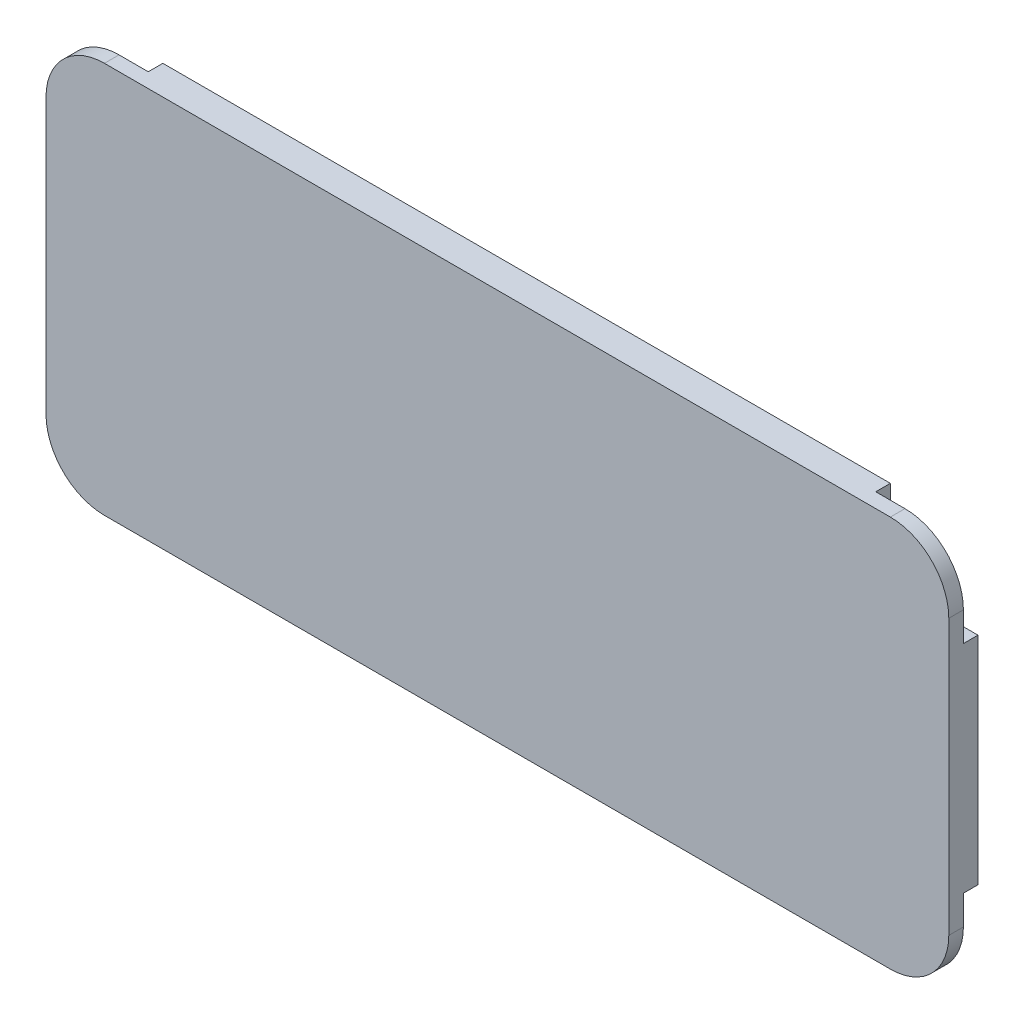
ISO-10303-21;
HEADER;
FILE_DESCRIPTION(('STEP AP214'),'2;1');
FILE_NAME('part.step','',(''),(''),'','','');
FILE_SCHEMA(('AUTOMOTIVE_DESIGN { 1 0 10303 214 1 1 1 1 }'));
ENDSEC;
DATA;
#1=APPLICATION_CONTEXT('core data for automotive mechanical design processes');
#2=APPLICATION_PROTOCOL_DEFINITION('international standard','automotive_design',2000,#1);
#3=PRODUCT_CONTEXT('',#1,'mechanical');
#4=PRODUCT('Part','Part','',(#3));
#5=PRODUCT_RELATED_PRODUCT_CATEGORY('part','',(#4));
#6=PRODUCT_DEFINITION_FORMATION('','',#4);
#7=PRODUCT_DEFINITION_CONTEXT('part definition',#1,'design');
#8=PRODUCT_DEFINITION('design','',#6,#7);
#9=PRODUCT_DEFINITION_SHAPE('','',#8);
#10=(LENGTH_UNIT() NAMED_UNIT(*) SI_UNIT(.MILLI.,.METRE.));
#11=(NAMED_UNIT(*) PLANE_ANGLE_UNIT() SI_UNIT($,.RADIAN.));
#12=(NAMED_UNIT(*) SI_UNIT($,.STERADIAN.) SOLID_ANGLE_UNIT());
#13=UNCERTAINTY_MEASURE_WITH_UNIT(LENGTH_MEASURE(1.E-05),#10,'distance_accuracy_value','');
#14=(GEOMETRIC_REPRESENTATION_CONTEXT(3) GLOBAL_UNCERTAINTY_ASSIGNED_CONTEXT((#13)) GLOBAL_UNIT_ASSIGNED_CONTEXT((#10,
#11,#12)) REPRESENTATION_CONTEXT('',''));
#15=CARTESIAN_POINT('',(0.,0.,0.));
#16=DIRECTION('',(0.,0.,1.));
#17=DIRECTION('',(1.,0.,0.));
#18=AXIS2_PLACEMENT_3D('',#15,#16,#17);
#19=CARTESIAN_POINT('',(2.,2.,1.));
#20=DIRECTION('',(0.,0.,-1.));
#21=DIRECTION('',(-1.,0.,0.));
#22=AXIS2_PLACEMENT_3D('',#19,#20,#21);
#23=CYLINDRICAL_SURFACE('',#22,2.);
#24=CARTESIAN_POINT('',(2.,2.,0.5));
#25=DIRECTION('',(0.,0.,-1.));
#26=DIRECTION('',(-1.,0.,0.));
#27=AXIS2_PLACEMENT_3D('',#24,#25,#26);
#28=CIRCLE('',#27,2.);
#29=CARTESIAN_POINT('',(2.00000000000001,0.,0.5));
#30=VERTEX_POINT('',#29);
#31=CARTESIAN_POINT('',(0.,1.99999999999998,0.5));
#32=VERTEX_POINT('',#31);
#33=EDGE_CURVE('E294',#30,#32,#28,.T.);
#34=ORIENTED_EDGE('',*,*,#33,.F.);
#35=DIRECTION('',(0.,0.,-1.));
#36=VECTOR('',#35,1.);
#37=CARTESIAN_POINT('',(2.00000000000001,0.,1.));
#38=LINE('',#37,#36);
#39=CARTESIAN_POINT('',(2.00000000000001,0.,1.));
#40=VERTEX_POINT('',#39);
#41=EDGE_CURVE('E372',#40,#30,#38,.T.);
#42=ORIENTED_EDGE('',*,*,#41,.F.);
#43=CARTESIAN_POINT('',(2.,2.,1.));
#44=DIRECTION('',(0.,0.,1.));
#45=DIRECTION('',(-1.,0.,0.));
#46=AXIS2_PLACEMENT_3D('',#43,#44,#45);
#47=CIRCLE('',#46,2.);
#48=CARTESIAN_POINT('',(0.,2.00000000000001,1.));
#49=VERTEX_POINT('',#48);
#50=EDGE_CURVE('E336',#49,#40,#47,.T.);
#51=ORIENTED_EDGE('',*,*,#50,.F.);
#52=DIRECTION('',(0.,0.,-1.));
#53=VECTOR('',#52,1.);
#54=CARTESIAN_POINT('',(0.,2.00000000000001,1.));
#55=LINE('',#54,#53);
#56=EDGE_CURVE('E41',#49,#32,#55,.T.);
#57=ORIENTED_EDGE('',*,*,#56,.T.);
#58=EDGE_LOOP('',(#34,#42,#51,#57));
#59=FACE_BOUND('',#58,.T.);
#60=ADVANCED_FACE('F33',(#59),#23,.T.);
#61=CARTESIAN_POINT('',(28.9,11.4,1.));
#62=DIRECTION('',(0.,0.,-1.));
#63=DIRECTION('',(-1.,0.,0.));
#64=AXIS2_PLACEMENT_3D('',#61,#62,#63);
#65=CYLINDRICAL_SURFACE('',#64,2.);
#66=CARTESIAN_POINT('',(28.9,11.4,0.5));
#67=DIRECTION('',(0.,0.,-1.));
#68=DIRECTION('',(-1.,0.,0.));
#69=AXIS2_PLACEMENT_3D('',#66,#67,#68);
#70=CIRCLE('',#69,2.);
#71=CARTESIAN_POINT('',(28.9,13.4,0.5));
#72=VERTEX_POINT('',#71);
#73=CARTESIAN_POINT('',(30.9,11.4,0.5));
#74=VERTEX_POINT('',#73);
#75=EDGE_CURVE('E321',#72,#74,#70,.T.);
#76=ORIENTED_EDGE('',*,*,#75,.F.);
#77=DIRECTION('',(0.,0.,-1.));
#78=VECTOR('',#77,1.);
#79=CARTESIAN_POINT('',(28.9,13.4,1.));
#80=LINE('',#79,#78);
#81=CARTESIAN_POINT('',(28.9,13.4,1.));
#82=VERTEX_POINT('',#81);
#83=EDGE_CURVE('E360',#82,#72,#80,.T.);
#84=ORIENTED_EDGE('',*,*,#83,.F.);
#85=CARTESIAN_POINT('',(28.9,11.4,1.));
#86=DIRECTION('',(0.,0.,1.));
#87=DIRECTION('',(-1.,0.,0.));
#88=AXIS2_PLACEMENT_3D('',#85,#86,#87);
#89=CIRCLE('',#88,2.);
#90=CARTESIAN_POINT('',(30.9,11.4,1.));
#91=VERTEX_POINT('',#90);
#92=EDGE_CURVE('E344',#91,#82,#89,.T.);
#93=ORIENTED_EDGE('',*,*,#92,.F.);
#94=DIRECTION('',(0.,0.,-1.));
#95=VECTOR('',#94,1.);
#96=CARTESIAN_POINT('',(30.9,11.4,1.));
#97=LINE('',#96,#95);
#98=EDGE_CURVE('E363',#91,#74,#97,.T.);
#99=ORIENTED_EDGE('',*,*,#98,.T.);
#100=EDGE_LOOP('',(#76,#84,#93,#99));
#101=FACE_BOUND('',#100,.T.);
#102=ADVANCED_FACE('F435',(#101),#65,.T.);
#103=CARTESIAN_POINT('',(2.,11.4,1.));
#104=DIRECTION('',(0.,0.,-1.));
#105=DIRECTION('',(-1.,0.,0.));
#106=AXIS2_PLACEMENT_3D('',#103,#104,#105);
#107=CYLINDRICAL_SURFACE('',#106,2.);
#108=DIRECTION('',(0.,0.,-1.));
#109=VECTOR('',#108,1.);
#110=CARTESIAN_POINT('',(2.,13.4,1.));
#111=LINE('',#110,#109);
#112=CARTESIAN_POINT('',(2.,13.4,1.));
#113=VERTEX_POINT('',#112);
#114=CARTESIAN_POINT('',(2.,13.4,0.5));
#115=VERTEX_POINT('',#114);
#116=EDGE_CURVE('E348',#113,#115,#111,.T.);
#117=ORIENTED_EDGE('',*,*,#116,.T.);
#118=CARTESIAN_POINT('',(2.,11.4,0.5));
#119=DIRECTION('',(0.,0.,1.));
#120=DIRECTION('',(1.,0.,0.));
#121=AXIS2_PLACEMENT_3D('',#118,#119,#120);
#122=CIRCLE('',#121,2.);
#123=CARTESIAN_POINT('',(0.,11.4,0.5));
#124=VERTEX_POINT('',#123);
#125=EDGE_CURVE('E228',#115,#124,#122,.T.);
#126=ORIENTED_EDGE('',*,*,#125,.T.);
#127=DIRECTION('',(0.,0.,-1.));
#128=VECTOR('',#127,1.);
#129=CARTESIAN_POINT('',(0.,11.4,1.));
#130=LINE('',#129,#128);
#131=CARTESIAN_POINT('',(0.,11.4,1.));
#132=VERTEX_POINT('',#131);
#133=EDGE_CURVE('E11',#132,#124,#130,.T.);
#134=ORIENTED_EDGE('',*,*,#133,.F.);
#135=CARTESIAN_POINT('',(2.,11.4,1.));
#136=DIRECTION('',(0.,0.,1.));
#137=DIRECTION('',(-1.,0.,0.));
#138=AXIS2_PLACEMENT_3D('',#135,#136,#137);
#139=CIRCLE('',#138,2.);
#140=EDGE_CURVE('E330',#113,#132,#139,.T.);
#141=ORIENTED_EDGE('',*,*,#140,.F.);
#142=EDGE_LOOP('',(#117,#126,#134,#141));
#143=FACE_BOUND('',#142,.T.);
#144=ADVANCED_FACE('F35',(#143),#107,.T.);
#145=CARTESIAN_POINT('',(0.,2.00000000000001,1.));
#146=DIRECTION('',(1.,0.,0.));
#147=DIRECTION('',(0.,0.,-1.));
#148=AXIS2_PLACEMENT_3D('',#145,#146,#147);
#149=PLANE('',#148);
#150=DIRECTION('',(0.,1.,0.));
#151=VECTOR('',#150,1.);
#152=CARTESIAN_POINT('',(0.,13.4,0.5));
#153=LINE('',#152,#151);
#154=CARTESIAN_POINT('',(0.,10.4,0.5));
#155=VERTEX_POINT('',#154);
#156=EDGE_CURVE('E209',#155,#124,#153,.T.);
#157=ORIENTED_EDGE('',*,*,#156,.F.);
#158=DIRECTION('',(0.,0.,-1.));
#159=VECTOR('',#158,1.);
#160=CARTESIAN_POINT('',(0.,10.4,0.5));
#161=LINE('',#160,#159);
#162=CARTESIAN_POINT('',(0.,10.4,0.));
#163=VERTEX_POINT('',#162);
#164=EDGE_CURVE('E200',#155,#163,#161,.T.);
#165=ORIENTED_EDGE('',*,*,#164,.T.);
#166=DIRECTION('',(0.,-1.,0.));
#167=VECTOR('',#166,1.);
#168=CARTESIAN_POINT('',(0.,2.00000000000001,0.));
#169=LINE('',#168,#167);
#170=CARTESIAN_POINT('',(0.,3.,0.));
#171=VERTEX_POINT('',#170);
#172=EDGE_CURVE('E329',#163,#171,#169,.T.);
#173=ORIENTED_EDGE('',*,*,#172,.T.);
#174=DIRECTION('',(0.,0.,-1.));
#175=VECTOR('',#174,1.);
#176=CARTESIAN_POINT('',(0.,3.,0.5));
#177=LINE('',#176,#175);
#178=CARTESIAN_POINT('',(0.,3.,0.5));
#179=VERTEX_POINT('',#178);
#180=EDGE_CURVE('E254',#179,#171,#177,.T.);
#181=ORIENTED_EDGE('',*,*,#180,.F.);
#182=DIRECTION('',(0.,1.,0.));
#183=VECTOR('',#182,1.);
#184=CARTESIAN_POINT('',(0.,0.,0.5));
#185=LINE('',#184,#183);
#186=EDGE_CURVE('E241',#32,#179,#185,.T.);
#187=ORIENTED_EDGE('',*,*,#186,.F.);
#188=ORIENTED_EDGE('',*,*,#56,.F.);
#189=DIRECTION('',(0.,-1.,0.));
#190=VECTOR('',#189,1.);
#191=CARTESIAN_POINT('',(0.,2.00000000000001,1.));
#192=LINE('',#191,#190);
#193=EDGE_CURVE('E333',#132,#49,#192,.T.);
#194=ORIENTED_EDGE('',*,*,#193,.F.);
#195=ORIENTED_EDGE('',*,*,#133,.T.);
#196=EDGE_LOOP('',(#157,#165,#173,#181,#187,#188,#194,#195));
#197=FACE_BOUND('',#196,.T.);
#198=ADVANCED_FACE('F382',(#197),#149,.F.);
#199=CARTESIAN_POINT('',(2.00000000000001,0.,1.));
#200=DIRECTION('',(0.,1.,0.));
#201=DIRECTION('',(0.,0.,1.));
#202=AXIS2_PLACEMENT_3D('',#199,#200,#201);
#203=PLANE('',#202);
#204=DIRECTION('',(-1.,0.,0.));
#205=VECTOR('',#204,1.);
#206=CARTESIAN_POINT('',(0.,0.,0.5));
#207=LINE('',#206,#205);
#208=CARTESIAN_POINT('',(3.,0.,0.5));
#209=VERTEX_POINT('',#208);
#210=EDGE_CURVE('E239',#209,#30,#207,.T.);
#211=ORIENTED_EDGE('',*,*,#210,.F.);
#212=DIRECTION('',(0.,0.,-1.));
#213=VECTOR('',#212,1.);
#214=CARTESIAN_POINT('',(3.,0.,0.5));
#215=LINE('',#214,#213);
#216=CARTESIAN_POINT('',(3.,0.,0.));
#217=VERTEX_POINT('',#216);
#218=EDGE_CURVE('E256',#209,#217,#215,.T.);
#219=ORIENTED_EDGE('',*,*,#218,.T.);
#220=DIRECTION('',(1.,0.,0.));
#221=VECTOR('',#220,1.);
#222=CARTESIAN_POINT('',(2.00000000000001,0.,0.));
#223=LINE('',#222,#221);
#224=CARTESIAN_POINT('',(27.9,0.,0.));
#225=VERTEX_POINT('',#224);
#226=EDGE_CURVE('E351',#217,#225,#223,.T.);
#227=ORIENTED_EDGE('',*,*,#226,.T.);
#228=DIRECTION('',(0.,0.,-1.));
#229=VECTOR('',#228,1.);
#230=CARTESIAN_POINT('',(27.9,0.,0.5));
#231=LINE('',#230,#229);
#232=CARTESIAN_POINT('',(27.9,0.,0.5));
#233=VERTEX_POINT('',#232);
#234=EDGE_CURVE('E282',#233,#225,#231,.T.);
#235=ORIENTED_EDGE('',*,*,#234,.F.);
#236=DIRECTION('',(-1.,0.,0.));
#237=VECTOR('',#236,1.);
#238=CARTESIAN_POINT('',(30.9,0.,0.5));
#239=LINE('',#238,#237);
#240=CARTESIAN_POINT('',(28.9,0.,0.5));
#241=VERTEX_POINT('',#240);
#242=EDGE_CURVE('E269',#241,#233,#239,.T.);
#243=ORIENTED_EDGE('',*,*,#242,.F.);
#244=DIRECTION('',(0.,0.,-1.));
#245=VECTOR('',#244,1.);
#246=CARTESIAN_POINT('',(28.9,0.,1.));
#247=LINE('',#246,#245);
#248=CARTESIAN_POINT('',(28.9,0.,1.));
#249=VERTEX_POINT('',#248);
#250=EDGE_CURVE('E369',#249,#241,#247,.T.);
#251=ORIENTED_EDGE('',*,*,#250,.F.);
#252=DIRECTION('',(1.,0.,0.));
#253=VECTOR('',#252,1.);
#254=CARTESIAN_POINT('',(2.00000000000001,0.,1.));
#255=LINE('',#254,#253);
#256=EDGE_CURVE('E338',#40,#249,#255,.T.);
#257=ORIENTED_EDGE('',*,*,#256,.F.);
#258=ORIENTED_EDGE('',*,*,#41,.T.);
#259=EDGE_LOOP('',(#211,#219,#227,#235,#243,#251,#257,#258));
#260=FACE_BOUND('',#259,.T.);
#261=ADVANCED_FACE('F396',(#260),#203,.F.);
#262=CARTESIAN_POINT('',(28.9,2.,1.));
#263=DIRECTION('',(0.,0.,-1.));
#264=DIRECTION('',(-1.,0.,0.));
#265=AXIS2_PLACEMENT_3D('',#262,#263,#264);
#266=CYLINDRICAL_SURFACE('',#265,2.);
#267=ORIENTED_EDGE('',*,*,#250,.T.);
#268=CARTESIAN_POINT('',(28.9,2.,0.5));
#269=DIRECTION('',(0.,0.,1.));
#270=DIRECTION('',(1.,0.,0.));
#271=AXIS2_PLACEMENT_3D('',#268,#269,#270);
#272=CIRCLE('',#271,2.);
#273=CARTESIAN_POINT('',(30.9,2.,0.5));
#274=VERTEX_POINT('',#273);
#275=EDGE_CURVE('E291',#241,#274,#272,.T.);
#276=ORIENTED_EDGE('',*,*,#275,.T.);
#277=DIRECTION('',(0.,0.,-1.));
#278=VECTOR('',#277,1.);
#279=CARTESIAN_POINT('',(30.9,2.,1.));
#280=LINE('',#279,#278);
#281=CARTESIAN_POINT('',(30.9,2.,1.));
#282=VERTEX_POINT('',#281);
#283=EDGE_CURVE('E366',#282,#274,#280,.T.);
#284=ORIENTED_EDGE('',*,*,#283,.F.);
#285=CARTESIAN_POINT('',(28.9,2.,1.));
#286=DIRECTION('',(0.,0.,1.));
#287=DIRECTION('',(1.,0.,0.));
#288=AXIS2_PLACEMENT_3D('',#285,#286,#287);
#289=CIRCLE('',#288,2.);
#290=EDGE_CURVE('E340',#249,#282,#289,.T.);
#291=ORIENTED_EDGE('',*,*,#290,.F.);
#292=EDGE_LOOP('',(#267,#276,#284,#291));
#293=FACE_BOUND('',#292,.T.);
#294=ADVANCED_FACE('F449',(#293),#266,.T.);
#295=CARTESIAN_POINT('',(30.9,2.,1.));
#296=DIRECTION('',(-1.,0.,0.));
#297=DIRECTION('',(0.,0.,1.));
#298=AXIS2_PLACEMENT_3D('',#295,#296,#297);
#299=PLANE('',#298);
#300=DIRECTION('',(0.,-1.,0.));
#301=VECTOR('',#300,1.);
#302=CARTESIAN_POINT('',(30.9,0.,0.5));
#303=LINE('',#302,#301);
#304=CARTESIAN_POINT('',(30.9,3.,0.5));
#305=VERTEX_POINT('',#304);
#306=EDGE_CURVE('E267',#305,#274,#303,.T.);
#307=ORIENTED_EDGE('',*,*,#306,.F.);
#308=DIRECTION('',(0.,0.,-1.));
#309=VECTOR('',#308,1.);
#310=CARTESIAN_POINT('',(30.9,3.,0.5));
#311=LINE('',#310,#309);
#312=CARTESIAN_POINT('',(30.9,3.,0.));
#313=VERTEX_POINT('',#312);
#314=EDGE_CURVE('E284',#305,#313,#311,.T.);
#315=ORIENTED_EDGE('',*,*,#314,.T.);
#316=DIRECTION('',(0.,1.,0.));
#317=VECTOR('',#316,1.);
#318=CARTESIAN_POINT('',(30.9,2.,0.));
#319=LINE('',#318,#317);
#320=CARTESIAN_POINT('',(30.9,10.4,0.));
#321=VERTEX_POINT('',#320);
#322=EDGE_CURVE('E354',#313,#321,#319,.T.);
#323=ORIENTED_EDGE('',*,*,#322,.T.);
#324=DIRECTION('',(0.,0.,-1.));
#325=VECTOR('',#324,1.);
#326=CARTESIAN_POINT('',(30.9,10.4,0.5));
#327=LINE('',#326,#325);
#328=CARTESIAN_POINT('',(30.9,10.4,0.5));
#329=VERTEX_POINT('',#328);
#330=EDGE_CURVE('E311',#329,#321,#327,.T.);
#331=ORIENTED_EDGE('',*,*,#330,.F.);
#332=DIRECTION('',(0.,-1.,0.));
#333=VECTOR('',#332,1.);
#334=CARTESIAN_POINT('',(30.9,13.4,0.5));
#335=LINE('',#334,#333);
#336=EDGE_CURVE('E297',#74,#329,#335,.T.);
#337=ORIENTED_EDGE('',*,*,#336,.F.);
#338=ORIENTED_EDGE('',*,*,#98,.F.);
#339=DIRECTION('',(0.,1.,0.));
#340=VECTOR('',#339,1.);
#341=CARTESIAN_POINT('',(30.9,2.,1.));
#342=LINE('',#341,#340);
#343=EDGE_CURVE('E342',#282,#91,#342,.T.);
#344=ORIENTED_EDGE('',*,*,#343,.F.);
#345=ORIENTED_EDGE('',*,*,#283,.T.);
#346=EDGE_LOOP('',(#307,#315,#323,#331,#337,#338,#344,#345));
#347=FACE_BOUND('',#346,.T.);
#348=ADVANCED_FACE('F619',(#347),#299,.F.);
#349=CARTESIAN_POINT('',(2.,13.4,1.));
#350=DIRECTION('',(0.,-1.,0.));
#351=DIRECTION('',(0.,0.,-1.));
#352=AXIS2_PLACEMENT_3D('',#349,#350,#351);
#353=PLANE('',#352);
#354=DIRECTION('',(-1.,0.,0.));
#355=VECTOR('',#354,1.);
#356=CARTESIAN_POINT('',(2.,13.4,0.));
#357=LINE('',#356,#355);
#358=CARTESIAN_POINT('',(27.9,13.4,0.));
#359=VERTEX_POINT('',#358);
#360=CARTESIAN_POINT('',(3.,13.4,0.));
#361=VERTEX_POINT('',#360);
#362=EDGE_CURVE('E334',#359,#361,#357,.T.);
#363=ORIENTED_EDGE('',*,*,#362,.T.);
#364=DIRECTION('',(0.,0.,-1.));
#365=VECTOR('',#364,1.);
#366=CARTESIAN_POINT('',(3.,13.4,0.5));
#367=LINE('',#366,#365);
#368=CARTESIAN_POINT('',(3.,13.4,0.5));
#369=VERTEX_POINT('',#368);
#370=EDGE_CURVE('E229',#369,#361,#367,.T.);
#371=ORIENTED_EDGE('',*,*,#370,.F.);
#372=DIRECTION('',(1.,0.,0.));
#373=VECTOR('',#372,1.);
#374=CARTESIAN_POINT('',(0.,13.4,0.5));
#375=LINE('',#374,#373);
#376=EDGE_CURVE('E220',#115,#369,#375,.T.);
#377=ORIENTED_EDGE('',*,*,#376,.F.);
#378=ORIENTED_EDGE('',*,*,#116,.F.);
#379=DIRECTION('',(-1.,0.,0.));
#380=VECTOR('',#379,1.);
#381=CARTESIAN_POINT('',(2.,13.4,1.));
#382=LINE('',#381,#380);
#383=EDGE_CURVE('E346',#82,#113,#382,.T.);
#384=ORIENTED_EDGE('',*,*,#383,.F.);
#385=ORIENTED_EDGE('',*,*,#83,.T.);
#386=DIRECTION('',(1.,0.,0.));
#387=VECTOR('',#386,1.);
#388=CARTESIAN_POINT('',(30.9,13.4,0.5));
#389=LINE('',#388,#387);
#390=CARTESIAN_POINT('',(27.9,13.4,0.5));
#391=VERTEX_POINT('',#390);
#392=EDGE_CURVE('E309',#391,#72,#389,.T.);
#393=ORIENTED_EDGE('',*,*,#392,.F.);
#394=DIRECTION('',(0.,0.,-1.));
#395=VECTOR('',#394,1.);
#396=CARTESIAN_POINT('',(27.9,13.4,0.5));
#397=LINE('',#396,#395);
#398=EDGE_CURVE('E318',#391,#359,#397,.T.);
#399=ORIENTED_EDGE('',*,*,#398,.T.);
#400=EDGE_LOOP('',(#363,#371,#377,#378,#384,#385,#393,#399));
#401=FACE_BOUND('',#400,.T.);
#402=ADVANCED_FACE('F414',(#401),#353,.F.);
#403=CARTESIAN_POINT('',(2.,11.4,1.));
#404=DIRECTION('',(0.,0.,-1.));
#405=DIRECTION('',(-1.,0.,0.));
#406=AXIS2_PLACEMENT_3D('',#403,#404,#405);
#407=PLANE('',#406);
#408=ORIENTED_EDGE('',*,*,#140,.T.);
#409=ORIENTED_EDGE('',*,*,#193,.T.);
#410=ORIENTED_EDGE('',*,*,#50,.T.);
#411=ORIENTED_EDGE('',*,*,#256,.T.);
#412=ORIENTED_EDGE('',*,*,#290,.T.);
#413=ORIENTED_EDGE('',*,*,#343,.T.);
#414=ORIENTED_EDGE('',*,*,#92,.T.);
#415=ORIENTED_EDGE('',*,*,#383,.T.);
#416=EDGE_LOOP('',(#408,#409,#410,#411,#412,#413,#414,#415));
#417=FACE_BOUND('',#416,.T.);
#418=ADVANCED_FACE('F403',(#417),#407,.F.);
#419=CARTESIAN_POINT('',(2.,11.4,0.));
#420=DIRECTION('',(0.,0.,-1.));
#421=DIRECTION('',(-1.,0.,0.));
#422=AXIS2_PLACEMENT_3D('',#419,#420,#421);
#423=PLANE('',#422);
#424=DIRECTION('',(0.,-1.,0.));
#425=VECTOR('',#424,1.);
#426=CARTESIAN_POINT('',(3.,13.4,0.));
#427=LINE('',#426,#425);
#428=CARTESIAN_POINT('',(2.99999999999998,10.9,0.));
#429=VERTEX_POINT('',#428);
#430=EDGE_CURVE('E213',#361,#429,#427,.T.);
#431=ORIENTED_EDGE('',*,*,#430,.F.);
#432=ORIENTED_EDGE('',*,*,#362,.F.);
#433=DIRECTION('',(0.,1.,0.));
#434=VECTOR('',#433,1.);
#435=CARTESIAN_POINT('',(27.9,13.4,0.));
#436=LINE('',#435,#434);
#437=CARTESIAN_POINT('',(27.9,10.9,0.));
#438=VERTEX_POINT('',#437);
#439=EDGE_CURVE('E300',#438,#359,#436,.T.);
#440=ORIENTED_EDGE('',*,*,#439,.F.);
#441=CARTESIAN_POINT('',(28.4,10.9,0.));
#442=DIRECTION('',(0.,0.,-1.));
#443=DIRECTION('',(-1.,0.,0.));
#444=AXIS2_PLACEMENT_3D('',#441,#442,#443);
#445=CIRCLE('',#444,0.5);
#446=CARTESIAN_POINT('',(28.4,10.4,0.));
#447=VERTEX_POINT('',#446);
#448=EDGE_CURVE('E314',#447,#438,#445,.T.);
#449=ORIENTED_EDGE('',*,*,#448,.F.);
#450=DIRECTION('',(-1.,0.,0.));
#451=VECTOR('',#450,1.);
#452=CARTESIAN_POINT('',(30.9,10.4,0.));
#453=LINE('',#452,#451);
#454=EDGE_CURVE('E296',#321,#447,#453,.T.);
#455=ORIENTED_EDGE('',*,*,#454,.F.);
#456=ORIENTED_EDGE('',*,*,#322,.F.);
#457=DIRECTION('',(1.,0.,0.));
#458=VECTOR('',#457,1.);
#459=CARTESIAN_POINT('',(30.9,3.,0.));
#460=LINE('',#459,#458);
#461=CARTESIAN_POINT('',(28.4,3.,0.));
#462=VERTEX_POINT('',#461);
#463=EDGE_CURVE('E277',#462,#313,#460,.T.);
#464=ORIENTED_EDGE('',*,*,#463,.F.);
#465=CARTESIAN_POINT('',(28.4,2.5,0.));
#466=DIRECTION('',(0.,0.,-1.));
#467=DIRECTION('',(1.,0.,0.));
#468=AXIS2_PLACEMENT_3D('',#465,#466,#467);
#469=CIRCLE('',#468,0.5);
#470=CARTESIAN_POINT('',(27.9,2.49999999999999,0.));
#471=VERTEX_POINT('',#470);
#472=EDGE_CURVE('E275',#471,#462,#469,.T.);
#473=ORIENTED_EDGE('',*,*,#472,.F.);
#474=DIRECTION('',(0.,1.,0.));
#475=VECTOR('',#474,1.);
#476=CARTESIAN_POINT('',(27.9,0.,0.));
#477=LINE('',#476,#475);
#478=EDGE_CURVE('E264',#225,#471,#477,.T.);
#479=ORIENTED_EDGE('',*,*,#478,.F.);
#480=ORIENTED_EDGE('',*,*,#226,.F.);
#481=DIRECTION('',(0.,-1.,0.));
#482=VECTOR('',#481,1.);
#483=CARTESIAN_POINT('',(3.,0.,0.));
#484=LINE('',#483,#482);
#485=CARTESIAN_POINT('',(2.99999999999998,2.49999999999999,0.));
#486=VERTEX_POINT('',#485);
#487=EDGE_CURVE('E248',#486,#217,#484,.T.);
#488=ORIENTED_EDGE('',*,*,#487,.F.);
#489=CARTESIAN_POINT('',(2.49999999999998,2.5,0.));
#490=DIRECTION('',(0.,0.,-1.));
#491=DIRECTION('',(-1.,0.,0.));
#492=AXIS2_PLACEMENT_3D('',#489,#490,#491);
#493=CIRCLE('',#492,0.5);
#494=CARTESIAN_POINT('',(2.49999999999997,3.,0.));
#495=VERTEX_POINT('',#494);
#496=EDGE_CURVE('E56',#495,#486,#493,.T.);
#497=ORIENTED_EDGE('',*,*,#496,.F.);
#498=DIRECTION('',(1.,0.,0.));
#499=VECTOR('',#498,1.);
#500=CARTESIAN_POINT('',(0.,3.,0.));
#501=LINE('',#500,#499);
#502=EDGE_CURVE('E236',#171,#495,#501,.T.);
#503=ORIENTED_EDGE('',*,*,#502,.F.);
#504=ORIENTED_EDGE('',*,*,#172,.F.);
#505=DIRECTION('',(-1.,0.,0.));
#506=VECTOR('',#505,1.);
#507=CARTESIAN_POINT('',(0.,10.4,0.));
#508=LINE('',#507,#506);
#509=CARTESIAN_POINT('',(2.49999999999997,10.4,0.));
#510=VERTEX_POINT('',#509);
#511=EDGE_CURVE('E216',#510,#163,#508,.T.);
#512=ORIENTED_EDGE('',*,*,#511,.F.);
#513=CARTESIAN_POINT('',(2.49999999999998,10.9,0.));
#514=DIRECTION('',(0.,0.,-1.));
#515=DIRECTION('',(1.,0.,0.));
#516=AXIS2_PLACEMENT_3D('',#513,#514,#515);
#517=CIRCLE('',#516,0.5);
#518=EDGE_CURVE('E48',#429,#510,#517,.T.);
#519=ORIENTED_EDGE('',*,*,#518,.F.);
#520=EDGE_LOOP('',(#431,#432,#440,#449,#455,#456,#464,#473,#479,#480,#488,#497,#503,#504,#512,#519));
#521=FACE_BOUND('',#520,.T.);
#522=ADVANCED_FACE('F420',(#521),#423,.T.);
#523=CARTESIAN_POINT('',(28.4,10.9,0.5));
#524=DIRECTION('',(0.,0.,-1.));
#525=DIRECTION('',(-1.,0.,0.));
#526=AXIS2_PLACEMENT_3D('',#523,#524,#525);
#527=PLANE('',#526);
#528=ORIENTED_EDGE('',*,*,#75,.T.);
#529=ORIENTED_EDGE('',*,*,#336,.T.);
#530=DIRECTION('',(-1.,0.,0.));
#531=VECTOR('',#530,1.);
#532=CARTESIAN_POINT('',(30.9,10.4,0.5));
#533=LINE('',#532,#531);
#534=CARTESIAN_POINT('',(28.4,10.4,0.5));
#535=VERTEX_POINT('',#534);
#536=EDGE_CURVE('E299',#329,#535,#533,.T.);
#537=ORIENTED_EDGE('',*,*,#536,.T.);
#538=CARTESIAN_POINT('',(28.4,10.9,0.5));
#539=DIRECTION('',(0.,0.,-1.));
#540=DIRECTION('',(-1.,0.,0.));
#541=AXIS2_PLACEMENT_3D('',#538,#539,#540);
#542=CIRCLE('',#541,0.5);
#543=CARTESIAN_POINT('',(27.9,10.9,0.5));
#544=VERTEX_POINT('',#543);
#545=EDGE_CURVE('E303',#535,#544,#542,.T.);
#546=ORIENTED_EDGE('',*,*,#545,.T.);
#547=DIRECTION('',(0.,1.,0.));
#548=VECTOR('',#547,1.);
#549=CARTESIAN_POINT('',(27.9,13.4,0.5));
#550=LINE('',#549,#548);
#551=EDGE_CURVE('E306',#544,#391,#550,.T.);
#552=ORIENTED_EDGE('',*,*,#551,.T.);
#553=ORIENTED_EDGE('',*,*,#392,.T.);
#554=EDGE_LOOP('',(#528,#529,#537,#546,#552,#553));
#555=FACE_BOUND('',#554,.T.);
#556=ADVANCED_FACE('F483',(#555),#527,.T.);
#557=CARTESIAN_POINT('',(27.9,13.4,0.5));
#558=DIRECTION('',(-1.,0.,0.));
#559=DIRECTION('',(0.,0.,1.));
#560=AXIS2_PLACEMENT_3D('',#557,#558,#559);
#561=PLANE('',#560);
#562=ORIENTED_EDGE('',*,*,#439,.T.);
#563=ORIENTED_EDGE('',*,*,#398,.F.);
#564=ORIENTED_EDGE('',*,*,#551,.F.);
#565=DIRECTION('',(0.,0.,-1.));
#566=VECTOR('',#565,1.);
#567=CARTESIAN_POINT('',(27.9,10.9,0.5));
#568=LINE('',#567,#566);
#569=EDGE_CURVE('E322',#544,#438,#568,.T.);
#570=ORIENTED_EDGE('',*,*,#569,.T.);
#571=EDGE_LOOP('',(#562,#563,#564,#570));
#572=FACE_BOUND('',#571,.T.);
#573=ADVANCED_FACE('F489',(#572),#561,.F.);
#574=CARTESIAN_POINT('',(28.4,10.9,0.5));
#575=DIRECTION('',(0.,0.,-1.));
#576=DIRECTION('',(-1.,0.,0.));
#577=AXIS2_PLACEMENT_3D('',#574,#575,#576);
#578=CYLINDRICAL_SURFACE('',#577,0.5);
#579=ORIENTED_EDGE('',*,*,#448,.T.);
#580=ORIENTED_EDGE('',*,*,#569,.F.);
#581=ORIENTED_EDGE('',*,*,#545,.F.);
#582=DIRECTION('',(0.,0.,-1.));
#583=VECTOR('',#582,1.);
#584=CARTESIAN_POINT('',(28.4,10.4,0.5));
#585=LINE('',#584,#583);
#586=EDGE_CURVE('E324',#535,#447,#585,.T.);
#587=ORIENTED_EDGE('',*,*,#586,.T.);
#588=EDGE_LOOP('',(#579,#580,#581,#587));
#589=FACE_BOUND('',#588,.T.);
#590=ADVANCED_FACE('F496',(#589),#578,.F.);
#591=CARTESIAN_POINT('',(30.9,10.4,0.5));
#592=DIRECTION('',(0.,-1.,0.));
#593=DIRECTION('',(0.,0.,-1.));
#594=AXIS2_PLACEMENT_3D('',#591,#592,#593);
#595=PLANE('',#594);
#596=ORIENTED_EDGE('',*,*,#454,.T.);
#597=ORIENTED_EDGE('',*,*,#586,.F.);
#598=ORIENTED_EDGE('',*,*,#536,.F.);
#599=ORIENTED_EDGE('',*,*,#330,.T.);
#600=EDGE_LOOP('',(#596,#597,#598,#599));
#601=FACE_BOUND('',#600,.T.);
#602=ADVANCED_FACE('F504',(#601),#595,.F.);
#603=CARTESIAN_POINT('',(28.4,2.5,0.5));
#604=DIRECTION('',(0.,0.,1.));
#605=DIRECTION('',(1.,0.,0.));
#606=AXIS2_PLACEMENT_3D('',#603,#604,#605);
#607=PLANE('',#606);
#608=ORIENTED_EDGE('',*,*,#242,.T.);
#609=DIRECTION('',(0.,1.,0.));
#610=VECTOR('',#609,1.);
#611=CARTESIAN_POINT('',(27.9,0.,0.5));
#612=LINE('',#611,#610);
#613=CARTESIAN_POINT('',(27.9,2.49999999999999,0.5));
#614=VERTEX_POINT('',#613);
#615=EDGE_CURVE('E271',#233,#614,#612,.T.);
#616=ORIENTED_EDGE('',*,*,#615,.T.);
#617=CARTESIAN_POINT('',(28.4,2.5,0.5));
#618=DIRECTION('',(0.,0.,-1.));
#619=DIRECTION('',(1.,0.,0.));
#620=AXIS2_PLACEMENT_3D('',#617,#618,#619);
#621=CIRCLE('',#620,0.5);
#622=CARTESIAN_POINT('',(28.4,3.,0.5));
#623=VERTEX_POINT('',#622);
#624=EDGE_CURVE('E260',#614,#623,#621,.T.);
#625=ORIENTED_EDGE('',*,*,#624,.T.);
#626=DIRECTION('',(1.,0.,0.));
#627=VECTOR('',#626,1.);
#628=CARTESIAN_POINT('',(30.9,3.,0.5));
#629=LINE('',#628,#627);
#630=EDGE_CURVE('E263',#623,#305,#629,.T.);
#631=ORIENTED_EDGE('',*,*,#630,.T.);
#632=ORIENTED_EDGE('',*,*,#306,.T.);
#633=ORIENTED_EDGE('',*,*,#275,.F.);
#634=EDGE_LOOP('',(#608,#616,#625,#631,#632,#633));
#635=FACE_BOUND('',#634,.T.);
#636=ADVANCED_FACE('F512',(#635),#607,.F.);
#637=CARTESIAN_POINT('',(28.4,2.5,0.5));
#638=DIRECTION('',(0.,0.,-1.));
#639=DIRECTION('',(-1.,0.,0.));
#640=AXIS2_PLACEMENT_3D('',#637,#638,#639);
#641=CYLINDRICAL_SURFACE('',#640,0.5);
#642=ORIENTED_EDGE('',*,*,#472,.T.);
#643=DIRECTION('',(0.,0.,-1.));
#644=VECTOR('',#643,1.);
#645=CARTESIAN_POINT('',(28.4,3.,0.5));
#646=LINE('',#645,#644);
#647=EDGE_CURVE('E274',#623,#462,#646,.T.);
#648=ORIENTED_EDGE('',*,*,#647,.F.);
#649=ORIENTED_EDGE('',*,*,#624,.F.);
#650=DIRECTION('',(0.,0.,-1.));
#651=VECTOR('',#650,1.);
#652=CARTESIAN_POINT('',(27.9,2.49999999999999,0.5));
#653=LINE('',#652,#651);
#654=EDGE_CURVE('E249',#614,#471,#653,.T.);
#655=ORIENTED_EDGE('',*,*,#654,.T.);
#656=EDGE_LOOP('',(#642,#648,#649,#655));
#657=FACE_BOUND('',#656,.T.);
#658=ADVANCED_FACE('F520',(#657),#641,.F.);
#659=CARTESIAN_POINT('',(27.9,0.,0.5));
#660=DIRECTION('',(-1.,0.,0.));
#661=DIRECTION('',(0.,0.,1.));
#662=AXIS2_PLACEMENT_3D('',#659,#660,#661);
#663=PLANE('',#662);
#664=ORIENTED_EDGE('',*,*,#478,.T.);
#665=ORIENTED_EDGE('',*,*,#654,.F.);
#666=ORIENTED_EDGE('',*,*,#615,.F.);
#667=ORIENTED_EDGE('',*,*,#234,.T.);
#668=EDGE_LOOP('',(#664,#665,#666,#667));
#669=FACE_BOUND('',#668,.T.);
#670=ADVANCED_FACE('F528',(#669),#663,.F.);
#671=CARTESIAN_POINT('',(30.9,3.,0.5));
#672=DIRECTION('',(0.,1.,0.));
#673=DIRECTION('',(0.,0.,1.));
#674=AXIS2_PLACEMENT_3D('',#671,#672,#673);
#675=PLANE('',#674);
#676=ORIENTED_EDGE('',*,*,#463,.T.);
#677=ORIENTED_EDGE('',*,*,#314,.F.);
#678=ORIENTED_EDGE('',*,*,#630,.F.);
#679=ORIENTED_EDGE('',*,*,#647,.T.);
#680=EDGE_LOOP('',(#676,#677,#678,#679));
#681=FACE_BOUND('',#680,.T.);
#682=ADVANCED_FACE('F536',(#681),#675,.F.);
#683=CARTESIAN_POINT('',(2.49999999999998,2.5,0.5));
#684=DIRECTION('',(0.,0.,-1.));
#685=DIRECTION('',(-1.,0.,0.));
#686=AXIS2_PLACEMENT_3D('',#683,#684,#685);
#687=PLANE('',#686);
#688=ORIENTED_EDGE('',*,*,#33,.T.);
#689=ORIENTED_EDGE('',*,*,#186,.T.);
#690=DIRECTION('',(1.,0.,0.));
#691=VECTOR('',#690,1.);
#692=CARTESIAN_POINT('',(0.,3.,0.5));
#693=LINE('',#692,#691);
#694=CARTESIAN_POINT('',(2.49999999999997,3.,0.5));
#695=VERTEX_POINT('',#694);
#696=EDGE_CURVE('E243',#179,#695,#693,.T.);
#697=ORIENTED_EDGE('',*,*,#696,.T.);
#698=CARTESIAN_POINT('',(2.49999999999998,2.5,0.5));
#699=DIRECTION('',(0.,0.,-1.));
#700=DIRECTION('',(-1.,0.,0.));
#701=AXIS2_PLACEMENT_3D('',#698,#699,#700);
#702=CIRCLE('',#701,0.5);
#703=CARTESIAN_POINT('',(2.99999999999998,2.49999999999999,0.5));
#704=VERTEX_POINT('',#703);
#705=EDGE_CURVE('E232',#695,#704,#702,.T.);
#706=ORIENTED_EDGE('',*,*,#705,.T.);
#707=DIRECTION('',(0.,-1.,0.));
#708=VECTOR('',#707,1.);
#709=CARTESIAN_POINT('',(3.,0.,0.5));
#710=LINE('',#709,#708);
#711=EDGE_CURVE('E235',#704,#209,#710,.T.);
#712=ORIENTED_EDGE('',*,*,#711,.T.);
#713=ORIENTED_EDGE('',*,*,#210,.T.);
#714=EDGE_LOOP('',(#688,#689,#697,#706,#712,#713));
#715=FACE_BOUND('',#714,.T.);
#716=ADVANCED_FACE('F386',(#715),#687,.T.);
#717=CARTESIAN_POINT('',(2.49999999999998,2.5,0.5));
#718=DIRECTION('',(0.,0.,-1.));
#719=DIRECTION('',(-1.,0.,0.));
#720=AXIS2_PLACEMENT_3D('',#717,#718,#719);
#721=CYLINDRICAL_SURFACE('',#720,0.5);
#722=ORIENTED_EDGE('',*,*,#496,.T.);
#723=DIRECTION('',(0.,0.,-1.));
#724=VECTOR('',#723,1.);
#725=CARTESIAN_POINT('',(2.99999999999998,2.49999999999999,0.5));
#726=LINE('',#725,#724);
#727=EDGE_CURVE('E246',#704,#486,#726,.T.);
#728=ORIENTED_EDGE('',*,*,#727,.F.);
#729=ORIENTED_EDGE('',*,*,#705,.F.);
#730=DIRECTION('',(0.,0.,-1.));
#731=VECTOR('',#730,1.);
#732=CARTESIAN_POINT('',(2.49999999999997,3.,0.5));
#733=LINE('',#732,#731);
#734=EDGE_CURVE('E224',#695,#495,#733,.T.);
#735=ORIENTED_EDGE('',*,*,#734,.T.);
#736=EDGE_LOOP('',(#722,#728,#729,#735));
#737=FACE_BOUND('',#736,.T.);
#738=ADVANCED_FACE('F391',(#737),#721,.F.);
#739=CARTESIAN_POINT('',(0.,3.,0.5));
#740=DIRECTION('',(0.,1.,0.));
#741=DIRECTION('',(0.,0.,1.));
#742=AXIS2_PLACEMENT_3D('',#739,#740,#741);
#743=PLANE('',#742);
#744=ORIENTED_EDGE('',*,*,#502,.T.);
#745=ORIENTED_EDGE('',*,*,#734,.F.);
#746=ORIENTED_EDGE('',*,*,#696,.F.);
#747=ORIENTED_EDGE('',*,*,#180,.T.);
#748=EDGE_LOOP('',(#744,#745,#746,#747));
#749=FACE_BOUND('',#748,.T.);
#750=ADVANCED_FACE('F388',(#749),#743,.F.);
#751=CARTESIAN_POINT('',(3.,0.,0.5));
#752=DIRECTION('',(1.,0.,0.));
#753=DIRECTION('',(0.,1.,0.));
#754=AXIS2_PLACEMENT_3D('',#751,#752,#753);
#755=PLANE('',#754);
#756=ORIENTED_EDGE('',*,*,#487,.T.);
#757=ORIENTED_EDGE('',*,*,#218,.F.);
#758=ORIENTED_EDGE('',*,*,#711,.F.);
#759=ORIENTED_EDGE('',*,*,#727,.T.);
#760=EDGE_LOOP('',(#756,#757,#758,#759));
#761=FACE_BOUND('',#760,.T.);
#762=ADVANCED_FACE('F424',(#761),#755,.F.);
#763=CARTESIAN_POINT('',(2.49999999999998,10.9,0.5));
#764=DIRECTION('',(0.,0.,1.));
#765=DIRECTION('',(1.,0.,0.));
#766=AXIS2_PLACEMENT_3D('',#763,#764,#765);
#767=PLANE('',#766);
#768=ORIENTED_EDGE('',*,*,#376,.T.);
#769=DIRECTION('',(0.,-1.,0.));
#770=VECTOR('',#769,1.);
#771=CARTESIAN_POINT('',(3.,13.4,0.5));
#772=LINE('',#771,#770);
#773=CARTESIAN_POINT('',(2.99999999999998,10.9,0.5));
#774=VERTEX_POINT('',#773);
#775=EDGE_CURVE('E201',#369,#774,#772,.T.);
#776=ORIENTED_EDGE('',*,*,#775,.T.);
#777=CARTESIAN_POINT('',(2.49999999999998,10.9,0.5));
#778=DIRECTION('',(0.,0.,-1.));
#779=DIRECTION('',(1.,0.,0.));
#780=AXIS2_PLACEMENT_3D('',#777,#778,#779);
#781=CIRCLE('',#780,0.5);
#782=CARTESIAN_POINT('',(2.49999999999997,10.4,0.5));
#783=VERTEX_POINT('',#782);
#784=EDGE_CURVE('E196',#774,#783,#781,.T.);
#785=ORIENTED_EDGE('',*,*,#784,.T.);
#786=DIRECTION('',(-1.,0.,0.));
#787=VECTOR('',#786,1.);
#788=CARTESIAN_POINT('',(0.,10.4,0.5));
#789=LINE('',#788,#787);
#790=EDGE_CURVE('E204',#783,#155,#789,.T.);
#791=ORIENTED_EDGE('',*,*,#790,.T.);
#792=ORIENTED_EDGE('',*,*,#156,.T.);
#793=ORIENTED_EDGE('',*,*,#125,.F.);
#794=EDGE_LOOP('',(#768,#776,#785,#791,#792,#793));
#795=FACE_BOUND('',#794,.T.);
#796=ADVANCED_FACE('F211',(#795),#767,.F.);
#797=CARTESIAN_POINT('',(2.49999999999998,10.9,0.5));
#798=DIRECTION('',(0.,0.,-1.));
#799=DIRECTION('',(-1.,0.,0.));
#800=AXIS2_PLACEMENT_3D('',#797,#798,#799);
#801=CYLINDRICAL_SURFACE('',#800,0.5);
#802=ORIENTED_EDGE('',*,*,#518,.T.);
#803=DIRECTION('',(0.,0.,-1.));
#804=VECTOR('',#803,1.);
#805=CARTESIAN_POINT('',(2.49999999999997,10.4,0.5));
#806=LINE('',#805,#804);
#807=EDGE_CURVE('E192',#783,#510,#806,.T.);
#808=ORIENTED_EDGE('',*,*,#807,.F.);
#809=ORIENTED_EDGE('',*,*,#784,.F.);
#810=DIRECTION('',(0.,0.,-1.));
#811=VECTOR('',#810,1.);
#812=CARTESIAN_POINT('',(2.99999999999998,10.9,0.5));
#813=LINE('',#812,#811);
#814=EDGE_CURVE('E226',#774,#429,#813,.T.);
#815=ORIENTED_EDGE('',*,*,#814,.T.);
#816=EDGE_LOOP('',(#802,#808,#809,#815));
#817=FACE_BOUND('',#816,.T.);
#818=ADVANCED_FACE('F194',(#817),#801,.F.);
#819=CARTESIAN_POINT('',(3.,13.4,0.5));
#820=DIRECTION('',(1.,0.,0.));
#821=DIRECTION('',(0.,1.,0.));
#822=AXIS2_PLACEMENT_3D('',#819,#820,#821);
#823=PLANE('',#822);
#824=ORIENTED_EDGE('',*,*,#430,.T.);
#825=ORIENTED_EDGE('',*,*,#814,.F.);
#826=ORIENTED_EDGE('',*,*,#775,.F.);
#827=ORIENTED_EDGE('',*,*,#370,.T.);
#828=EDGE_LOOP('',(#824,#825,#826,#827));
#829=FACE_BOUND('',#828,.T.);
#830=ADVANCED_FACE('F418',(#829),#823,.F.);
#831=CARTESIAN_POINT('',(0.,10.4,0.5));
#832=DIRECTION('',(0.,-1.,0.));
#833=DIRECTION('',(0.,0.,-1.));
#834=AXIS2_PLACEMENT_3D('',#831,#832,#833);
#835=PLANE('',#834);
#836=ORIENTED_EDGE('',*,*,#511,.T.);
#837=ORIENTED_EDGE('',*,*,#164,.F.);
#838=ORIENTED_EDGE('',*,*,#790,.F.);
#839=ORIENTED_EDGE('',*,*,#807,.T.);
#840=EDGE_LOOP('',(#836,#837,#838,#839));
#841=FACE_BOUND('',#840,.T.);
#842=ADVANCED_FACE('F205',(#841),#835,.F.);
#843=CLOSED_SHELL('',(#60,#102,#144,#198,#261,#294,#348,#402,#418,#522,#556,#573,#590,#602,#636,
#658,#670,#682,#716,#738,#750,#762,#796,#818,#830,#842));
#844=MANIFOLD_SOLID_BREP('B2',#843);
#845=ADVANCED_BREP_SHAPE_REPRESENTATION('',(#18,#844),#14);
#846=SHAPE_DEFINITION_REPRESENTATION(#9,#845);
ENDSEC;
END-ISO-10303-21;
